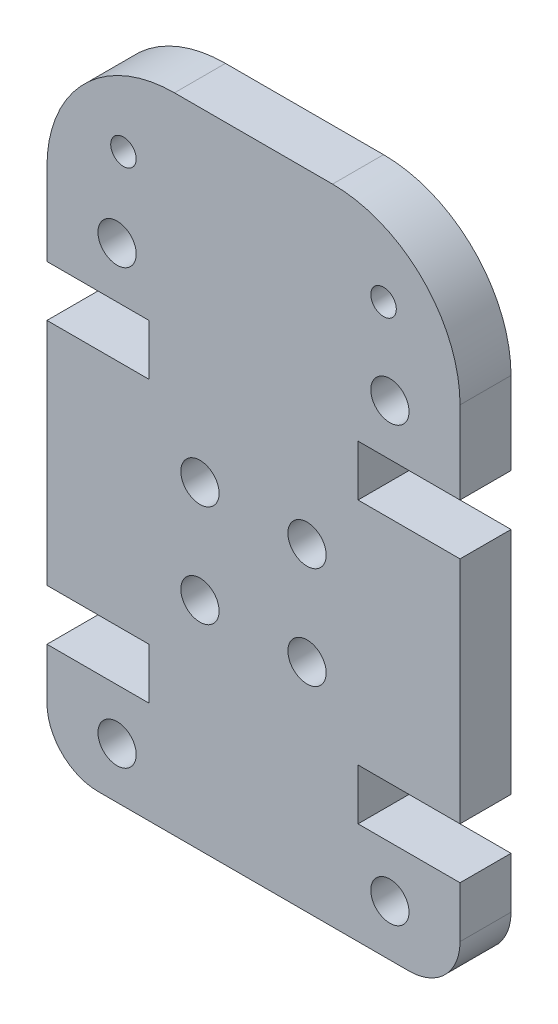
ISO-10303-21;
HEADER;
FILE_DESCRIPTION(('STEP AP214'),'2;1');
FILE_NAME('part.step','',(''),(''),'','','');
FILE_SCHEMA(('AUTOMOTIVE_DESIGN { 1 0 10303 214 1 1 1 1 }'));
ENDSEC;
DATA;
#1=APPLICATION_CONTEXT('core data for automotive mechanical design processes');
#2=APPLICATION_PROTOCOL_DEFINITION('international standard','automotive_design',2000,#1);
#3=PRODUCT_CONTEXT('',#1,'mechanical');
#4=PRODUCT('Part','Part','',(#3));
#5=PRODUCT_RELATED_PRODUCT_CATEGORY('part','',(#4));
#6=PRODUCT_DEFINITION_FORMATION('','',#4);
#7=PRODUCT_DEFINITION_CONTEXT('part definition',#1,'design');
#8=PRODUCT_DEFINITION('design','',#6,#7);
#9=PRODUCT_DEFINITION_SHAPE('','',#8);
#10=(LENGTH_UNIT() NAMED_UNIT(*) SI_UNIT(.MILLI.,.METRE.));
#11=(NAMED_UNIT(*) PLANE_ANGLE_UNIT() SI_UNIT($,.RADIAN.));
#12=(NAMED_UNIT(*) SI_UNIT($,.STERADIAN.) SOLID_ANGLE_UNIT());
#13=UNCERTAINTY_MEASURE_WITH_UNIT(LENGTH_MEASURE(1.E-05),#10,'distance_accuracy_value','');
#14=(GEOMETRIC_REPRESENTATION_CONTEXT(3) GLOBAL_UNCERTAINTY_ASSIGNED_CONTEXT((#13)) GLOBAL_UNIT_ASSIGNED_CONTEXT((#10,
#11,#12)) REPRESENTATION_CONTEXT('',''));
#15=CARTESIAN_POINT('',(0.,0.,0.));
#16=DIRECTION('',(0.,0.,1.));
#17=DIRECTION('',(1.,0.,0.));
#18=AXIS2_PLACEMENT_3D('',#15,#16,#17);
#19=CARTESIAN_POINT('',(14.2,2.00000000000003,2.));
#20=DIRECTION('',(0.,0.,-1.));
#21=DIRECTION('',(-1.,0.,0.));
#22=AXIS2_PLACEMENT_3D('',#19,#20,#21);
#23=PLANE('',#22);
#24=CARTESIAN_POINT('',(3.00000000000323,22.2299999999968,2.));
#25=DIRECTION('',(0.,0.,1.));
#26=DIRECTION('',(1.,0.,0.));
#27=AXIS2_PLACEMENT_3D('',#24,#25,#26);
#28=CIRCLE('',#27,0.499999999999944);
#29=CARTESIAN_POINT('',(3.50000000000317,22.2299999999968,2.));
#30=VERTEX_POINT('',#29);
#31=EDGE_CURVE('E472',#30,#30,#28,.T.);
#32=ORIENTED_EDGE('',*,*,#31,.F.);
#33=EDGE_LOOP('',(#32));
#34=FACE_BOUND('',#33,.T.);
#35=CARTESIAN_POINT('',(2.75000000000002,19.0000000000043,2.));
#36=DIRECTION('',(0.,0.,1.));
#37=DIRECTION('',(-1.,0.,0.));
#38=AXIS2_PLACEMENT_3D('',#35,#36,#37);
#39=CIRCLE('',#38,0.749999999999999);
#40=CARTESIAN_POINT('',(2.00000000000002,19.0000000000043,2.));
#41=VERTEX_POINT('',#40);
#42=EDGE_CURVE('E484',#41,#41,#39,.T.);
#43=ORIENTED_EDGE('',*,*,#42,.F.);
#44=EDGE_LOOP('',(#43));
#45=FACE_BOUND('',#44,.T.);
#46=CARTESIAN_POINT('',(10.1999999999989,12.5000000000022,2.));
#47=DIRECTION('',(0.,0.,1.));
#48=DIRECTION('',(1.,0.,0.));
#49=AXIS2_PLACEMENT_3D('',#46,#47,#48);
#50=CIRCLE('',#49,0.749999999999998);
#51=CARTESIAN_POINT('',(10.9499999999989,12.5000000000022,2.));
#52=VERTEX_POINT('',#51);
#53=EDGE_CURVE('E496',#52,#52,#50,.T.);
#54=ORIENTED_EDGE('',*,*,#53,.F.);
#55=EDGE_LOOP('',(#54));
#56=FACE_BOUND('',#55,.T.);
#57=CARTESIAN_POINT('',(10.1999999999989,8.5000000000022,2.));
#58=DIRECTION('',(0.,0.,1.));
#59=DIRECTION('',(-1.,0.,0.));
#60=AXIS2_PLACEMENT_3D('',#57,#58,#59);
#61=CIRCLE('',#60,0.749999999999998);
#62=CARTESIAN_POINT('',(9.44999999999887,8.5000000000022,2.));
#63=VERTEX_POINT('',#62);
#64=EDGE_CURVE('E508',#63,#63,#61,.T.);
#65=ORIENTED_EDGE('',*,*,#64,.F.);
#66=EDGE_LOOP('',(#65));
#67=FACE_BOUND('',#66,.T.);
#68=CARTESIAN_POINT('',(13.45,2.00000000000003,2.));
#69=DIRECTION('',(0.,0.,1.));
#70=DIRECTION('',(-1.,0.,0.));
#71=AXIS2_PLACEMENT_3D('',#68,#69,#70);
#72=CIRCLE('',#71,0.750000000000002);
#73=CARTESIAN_POINT('',(12.7,2.00000000000003,2.));
#74=VERTEX_POINT('',#73);
#75=EDGE_CURVE('E230',#74,#74,#72,.T.);
#76=ORIENTED_EDGE('',*,*,#75,.F.);
#77=EDGE_LOOP('',(#76));
#78=FACE_BOUND('',#77,.T.);
#79=CARTESIAN_POINT('',(14.2,2.00000000000003,2.));
#80=DIRECTION('',(0.,0.,1.));
#81=DIRECTION('',(-1.,0.,0.));
#82=AXIS2_PLACEMENT_3D('',#79,#80,#81);
#83=CIRCLE('',#82,2.00000000000003);
#84=CARTESIAN_POINT('',(14.2,0.,2.));
#85=VERTEX_POINT('',#84);
#86=CARTESIAN_POINT('',(16.2,2.00000000000003,2.));
#87=VERTEX_POINT('',#86);
#88=EDGE_CURVE('E273',#85,#87,#83,.T.);
#89=ORIENTED_EDGE('',*,*,#88,.T.);
#90=DIRECTION('',(0.,1.,0.));
#91=VECTOR('',#90,1.);
#92=CARTESIAN_POINT('',(16.2,2.00000000000003,2.));
#93=LINE('',#92,#91);
#94=CARTESIAN_POINT('',(16.2,4.00000000000006,2.));
#95=VERTEX_POINT('',#94);
#96=EDGE_CURVE('E141',#87,#95,#93,.T.);
#97=ORIENTED_EDGE('',*,*,#96,.T.);
#98=DIRECTION('',(-1.,0.,0.));
#99=VECTOR('',#98,1.);
#100=CARTESIAN_POINT('',(12.1999999999999,4.00000000000006,2.));
#101=LINE('',#100,#99);
#102=CARTESIAN_POINT('',(12.1999999999999,4.00000000000006,2.));
#103=VERTEX_POINT('',#102);
#104=EDGE_CURVE('E336',#95,#103,#101,.T.);
#105=ORIENTED_EDGE('',*,*,#104,.T.);
#106=DIRECTION('',(0.,1.,0.));
#107=VECTOR('',#106,1.);
#108=CARTESIAN_POINT('',(12.1999999999999,6.00000000000009,2.));
#109=LINE('',#108,#107);
#110=CARTESIAN_POINT('',(12.1999999999999,6.00000000000009,2.));
#111=VERTEX_POINT('',#110);
#112=EDGE_CURVE('E355',#103,#111,#109,.T.);
#113=ORIENTED_EDGE('',*,*,#112,.T.);
#114=DIRECTION('',(1.,0.,0.));
#115=VECTOR('',#114,1.);
#116=CARTESIAN_POINT('',(16.2,6.00000000000009,2.));
#117=LINE('',#116,#115);
#118=CARTESIAN_POINT('',(16.2,6.00000000000009,2.));
#119=VERTEX_POINT('',#118);
#120=EDGE_CURVE('E352',#111,#119,#117,.T.);
#121=ORIENTED_EDGE('',*,*,#120,.T.);
#122=DIRECTION('',(0.,1.,0.));
#123=VECTOR('',#122,1.);
#124=CARTESIAN_POINT('',(16.2,6.00000000000009,2.));
#125=LINE('',#124,#123);
#126=CARTESIAN_POINT('',(16.2,15.0000000000043,2.));
#127=VERTEX_POINT('',#126);
#128=EDGE_CURVE('E354',#119,#127,#125,.T.);
#129=ORIENTED_EDGE('',*,*,#128,.T.);
#130=DIRECTION('',(-1.,0.,0.));
#131=VECTOR('',#130,1.);
#132=CARTESIAN_POINT('',(16.2,15.0000000000043,2.));
#133=LINE('',#132,#131);
#134=CARTESIAN_POINT('',(12.1999999999999,15.0000000000043,2.));
#135=VERTEX_POINT('',#134);
#136=EDGE_CURVE('E357',#127,#135,#133,.T.);
#137=ORIENTED_EDGE('',*,*,#136,.T.);
#138=DIRECTION('',(0.,1.,0.));
#139=VECTOR('',#138,1.);
#140=CARTESIAN_POINT('',(12.1999999999999,15.0000000000043,2.));
#141=LINE('',#140,#139);
#142=CARTESIAN_POINT('',(12.1999999999999,17.0000000000043,2.));
#143=VERTEX_POINT('',#142);
#144=EDGE_CURVE('E363',#135,#143,#141,.T.);
#145=ORIENTED_EDGE('',*,*,#144,.T.);
#146=DIRECTION('',(1.,0.,0.));
#147=VECTOR('',#146,1.);
#148=CARTESIAN_POINT('',(12.1999999999999,17.0000000000043,2.));
#149=LINE('',#148,#147);
#150=CARTESIAN_POINT('',(16.2,17.0000000000043,2.));
#151=VERTEX_POINT('',#150);
#152=EDGE_CURVE('E365',#143,#151,#149,.T.);
#153=ORIENTED_EDGE('',*,*,#152,.T.);
#154=DIRECTION('',(0.,1.,0.));
#155=VECTOR('',#154,1.);
#156=CARTESIAN_POINT('',(16.2,20.23,2.));
#157=LINE('',#156,#155);
#158=CARTESIAN_POINT('',(16.2,20.23,2.));
#159=VERTEX_POINT('',#158);
#160=EDGE_CURVE('E367',#151,#159,#157,.T.);
#161=ORIENTED_EDGE('',*,*,#160,.T.);
#162=CARTESIAN_POINT('',(11.2,20.23,2.));
#163=DIRECTION('',(0.,0.,1.));
#164=DIRECTION('',(-1.,0.,0.));
#165=AXIS2_PLACEMENT_3D('',#162,#163,#164);
#166=CIRCLE('',#165,5.00000000000002);
#167=CARTESIAN_POINT('',(11.2,25.23,2.));
#168=VERTEX_POINT('',#167);
#169=EDGE_CURVE('E369',#159,#168,#166,.T.);
#170=ORIENTED_EDGE('',*,*,#169,.T.);
#171=DIRECTION('',(-1.,0.,0.));
#172=VECTOR('',#171,1.);
#173=CARTESIAN_POINT('',(5.00000000000002,25.23,2.));
#174=LINE('',#173,#172);
#175=CARTESIAN_POINT('',(5.00000000000002,25.23,2.));
#176=VERTEX_POINT('',#175);
#177=EDGE_CURVE('E371',#168,#176,#174,.T.);
#178=ORIENTED_EDGE('',*,*,#177,.T.);
#179=CARTESIAN_POINT('',(5.00000000000002,20.23,2.));
#180=DIRECTION('',(0.,0.,1.));
#181=DIRECTION('',(1.,0.,0.));
#182=AXIS2_PLACEMENT_3D('',#179,#180,#181);
#183=CIRCLE('',#182,5.00000000000002);
#184=CARTESIAN_POINT('',(0.,20.23,2.));
#185=VERTEX_POINT('',#184);
#186=EDGE_CURVE('E373',#176,#185,#183,.T.);
#187=ORIENTED_EDGE('',*,*,#186,.T.);
#188=DIRECTION('',(0.,-1.,0.));
#189=VECTOR('',#188,1.);
#190=CARTESIAN_POINT('',(0.,20.23,2.));
#191=LINE('',#190,#189);
#192=CARTESIAN_POINT('',(0.,17.0000000000043,2.));
#193=VERTEX_POINT('',#192);
#194=EDGE_CURVE('E375',#185,#193,#191,.T.);
#195=ORIENTED_EDGE('',*,*,#194,.T.);
#196=DIRECTION('',(1.,0.,0.));
#197=VECTOR('',#196,1.);
#198=CARTESIAN_POINT('',(4.00000000000004,17.0000000000043,2.));
#199=LINE('',#198,#197);
#200=CARTESIAN_POINT('',(4.00000000000004,17.0000000000043,2.));
#201=VERTEX_POINT('',#200);
#202=EDGE_CURVE('E377',#193,#201,#199,.T.);
#203=ORIENTED_EDGE('',*,*,#202,.T.);
#204=DIRECTION('',(0.,-1.,0.));
#205=VECTOR('',#204,1.);
#206=CARTESIAN_POINT('',(4.00000000000004,15.0000000000043,2.));
#207=LINE('',#206,#205);
#208=CARTESIAN_POINT('',(4.00000000000004,15.0000000000043,2.));
#209=VERTEX_POINT('',#208);
#210=EDGE_CURVE('E379',#201,#209,#207,.T.);
#211=ORIENTED_EDGE('',*,*,#210,.T.);
#212=DIRECTION('',(-1.,0.,0.));
#213=VECTOR('',#212,1.);
#214=CARTESIAN_POINT('',(0.,15.0000000000043,2.));
#215=LINE('',#214,#213);
#216=CARTESIAN_POINT('',(0.,15.0000000000043,2.));
#217=VERTEX_POINT('',#216);
#218=EDGE_CURVE('E381',#209,#217,#215,.T.);
#219=ORIENTED_EDGE('',*,*,#218,.T.);
#220=DIRECTION('',(0.,-1.,0.));
#221=VECTOR('',#220,1.);
#222=CARTESIAN_POINT('',(0.,6.00000000000003,2.));
#223=LINE('',#222,#221);
#224=CARTESIAN_POINT('',(0.,6.00000000000003,2.));
#225=VERTEX_POINT('',#224);
#226=EDGE_CURVE('E383',#217,#225,#223,.T.);
#227=ORIENTED_EDGE('',*,*,#226,.T.);
#228=DIRECTION('',(1.,0.,0.));
#229=VECTOR('',#228,1.);
#230=CARTESIAN_POINT('',(0.,6.00000000000003,2.));
#231=LINE('',#230,#229);
#232=CARTESIAN_POINT('',(4.00000000000004,6.00000000000003,2.));
#233=VERTEX_POINT('',#232);
#234=EDGE_CURVE('E385',#225,#233,#231,.T.);
#235=ORIENTED_EDGE('',*,*,#234,.T.);
#236=DIRECTION('',(0.,-1.,0.));
#237=VECTOR('',#236,1.);
#238=CARTESIAN_POINT('',(4.00000000000004,6.00000000000003,2.));
#239=LINE('',#238,#237);
#240=CARTESIAN_POINT('',(4.00000000000004,4.00000000000002,2.));
#241=VERTEX_POINT('',#240);
#242=EDGE_CURVE('E387',#233,#241,#239,.T.);
#243=ORIENTED_EDGE('',*,*,#242,.T.);
#244=DIRECTION('',(-1.,0.,0.));
#245=VECTOR('',#244,1.);
#246=CARTESIAN_POINT('',(4.00000000000004,4.00000000000002,2.));
#247=LINE('',#246,#245);
#248=CARTESIAN_POINT('',(0.,4.,2.));
#249=VERTEX_POINT('',#248);
#250=EDGE_CURVE('E208',#241,#249,#247,.T.);
#251=ORIENTED_EDGE('',*,*,#250,.T.);
#252=DIRECTION('',(0.,-1.,0.));
#253=VECTOR('',#252,1.);
#254=CARTESIAN_POINT('',(0.,2.00000000000003,2.));
#255=LINE('',#254,#253);
#256=CARTESIAN_POINT('',(0.,2.00000000000003,2.));
#257=VERTEX_POINT('',#256);
#258=EDGE_CURVE('E202',#249,#257,#255,.T.);
#259=ORIENTED_EDGE('',*,*,#258,.T.);
#260=CARTESIAN_POINT('',(2.00000000000001,2.00000000000003,2.));
#261=DIRECTION('',(0.,0.,1.));
#262=DIRECTION('',(1.,0.,0.));
#263=AXIS2_PLACEMENT_3D('',#260,#261,#262);
#264=CIRCLE('',#263,2.00000000000001);
#265=CARTESIAN_POINT('',(2.00000000000001,0.,2.));
#266=VERTEX_POINT('',#265);
#267=EDGE_CURVE('E206',#257,#266,#264,.T.);
#268=ORIENTED_EDGE('',*,*,#267,.T.);
#269=DIRECTION('',(1.,0.,0.));
#270=VECTOR('',#269,1.);
#271=CARTESIAN_POINT('',(2.00000000000001,0.,2.));
#272=LINE('',#271,#270);
#273=EDGE_CURVE('E50',#266,#85,#272,.T.);
#274=ORIENTED_EDGE('',*,*,#273,.T.);
#275=EDGE_LOOP('',(#89,#97,#105,#113,#121,#129,#137,#145,#153,#161,#170,#178,#187,#195,#203,
#211,#219,#227,#235,#243,#251,#259,#268,#274));
#276=FACE_BOUND('',#275,.T.);
#277=CARTESIAN_POINT('',(13.1999999999968,22.2299999999968,2.));
#278=DIRECTION('',(0.,0.,1.));
#279=DIRECTION('',(-1.,0.,0.));
#280=AXIS2_PLACEMENT_3D('',#277,#278,#279);
#281=CIRCLE('',#280,0.499999999999944);
#282=CARTESIAN_POINT('',(12.6999999999968,22.2299999999968,2.));
#283=VERTEX_POINT('',#282);
#284=EDGE_CURVE('E514',#283,#283,#281,.T.);
#285=ORIENTED_EDGE('',*,*,#284,.F.);
#286=EDGE_LOOP('',(#285));
#287=FACE_BOUND('',#286,.T.);
#288=CARTESIAN_POINT('',(13.45,19.0000000000043,2.));
#289=DIRECTION('',(0.,0.,1.));
#290=DIRECTION('',(1.,0.,0.));
#291=AXIS2_PLACEMENT_3D('',#288,#289,#290);
#292=CIRCLE('',#291,0.749999999999999);
#293=CARTESIAN_POINT('',(14.2,19.0000000000043,2.));
#294=VERTEX_POINT('',#293);
#295=EDGE_CURVE('E502',#294,#294,#292,.T.);
#296=ORIENTED_EDGE('',*,*,#295,.F.);
#297=EDGE_LOOP('',(#296));
#298=FACE_BOUND('',#297,.T.);
#299=CARTESIAN_POINT('',(6.00000000000113,8.5000000000022,2.));
#300=DIRECTION('',(0.,0.,1.));
#301=DIRECTION('',(1.,0.,0.));
#302=AXIS2_PLACEMENT_3D('',#299,#300,#301);
#303=CIRCLE('',#302,0.749999999999999);
#304=CARTESIAN_POINT('',(6.75000000000113,8.5000000000022,2.));
#305=VERTEX_POINT('',#304);
#306=EDGE_CURVE('E490',#305,#305,#303,.T.);
#307=ORIENTED_EDGE('',*,*,#306,.F.);
#308=EDGE_LOOP('',(#307));
#309=FACE_BOUND('',#308,.T.);
#310=CARTESIAN_POINT('',(6.00000000000113,12.5000000000022,2.));
#311=DIRECTION('',(0.,0.,1.));
#312=DIRECTION('',(-1.,0.,0.));
#313=AXIS2_PLACEMENT_3D('',#310,#311,#312);
#314=CIRCLE('',#313,0.749999999999999);
#315=CARTESIAN_POINT('',(5.25000000000113,12.5000000000022,2.));
#316=VERTEX_POINT('',#315);
#317=EDGE_CURVE('E478',#316,#316,#314,.T.);
#318=ORIENTED_EDGE('',*,*,#317,.F.);
#319=EDGE_LOOP('',(#318));
#320=FACE_BOUND('',#319,.T.);
#321=CARTESIAN_POINT('',(2.75000000000002,2.00000000000025,2.));
#322=DIRECTION('',(0.,0.,1.));
#323=DIRECTION('',(1.,0.,0.));
#324=AXIS2_PLACEMENT_3D('',#321,#322,#323);
#325=CIRCLE('',#324,0.750000000002987);
#326=CARTESIAN_POINT('',(3.50000000000301,2.00000000000025,2.));
#327=VERTEX_POINT('',#326);
#328=EDGE_CURVE('E463',#327,#327,#325,.T.);
#329=ORIENTED_EDGE('',*,*,#328,.F.);
#330=EDGE_LOOP('',(#329));
#331=FACE_BOUND('',#330,.T.);
#332=ADVANCED_FACE('F33',(#34,#45,#56,#67,#78,#276,#287,#298,#309,#320,#331),#23,.F.);
#333=CARTESIAN_POINT('',(14.2,2.00000000000003,0.));
#334=DIRECTION('',(0.,0.,-1.));
#335=DIRECTION('',(-1.,0.,0.));
#336=AXIS2_PLACEMENT_3D('',#333,#334,#335);
#337=PLANE('',#336);
#338=CARTESIAN_POINT('',(3.00000000000323,22.2299999999968,0.));
#339=DIRECTION('',(0.,0.,1.));
#340=DIRECTION('',(1.,0.,0.));
#341=AXIS2_PLACEMENT_3D('',#338,#339,#340);
#342=CIRCLE('',#341,0.499999999999944);
#343=CARTESIAN_POINT('',(3.50000000000317,22.2299999999968,0.));
#344=VERTEX_POINT('',#343);
#345=EDGE_CURVE('E469',#344,#344,#342,.T.);
#346=ORIENTED_EDGE('',*,*,#345,.T.);
#347=EDGE_LOOP('',(#346));
#348=FACE_BOUND('',#347,.T.);
#349=CARTESIAN_POINT('',(2.75000000000002,19.0000000000043,0.));
#350=DIRECTION('',(0.,0.,1.));
#351=DIRECTION('',(-1.,0.,0.));
#352=AXIS2_PLACEMENT_3D('',#349,#350,#351);
#353=CIRCLE('',#352,0.749999999999999);
#354=CARTESIAN_POINT('',(2.00000000000002,19.0000000000043,0.));
#355=VERTEX_POINT('',#354);
#356=EDGE_CURVE('E481',#355,#355,#353,.T.);
#357=ORIENTED_EDGE('',*,*,#356,.T.);
#358=EDGE_LOOP('',(#357));
#359=FACE_BOUND('',#358,.T.);
#360=CARTESIAN_POINT('',(10.1999999999989,12.5000000000022,0.));
#361=DIRECTION('',(0.,0.,1.));
#362=DIRECTION('',(1.,0.,0.));
#363=AXIS2_PLACEMENT_3D('',#360,#361,#362);
#364=CIRCLE('',#363,0.749999999999998);
#365=CARTESIAN_POINT('',(10.9499999999989,12.5000000000022,0.));
#366=VERTEX_POINT('',#365);
#367=EDGE_CURVE('E493',#366,#366,#364,.T.);
#368=ORIENTED_EDGE('',*,*,#367,.T.);
#369=EDGE_LOOP('',(#368));
#370=FACE_BOUND('',#369,.T.);
#371=CARTESIAN_POINT('',(10.1999999999989,8.5000000000022,0.));
#372=DIRECTION('',(0.,0.,1.));
#373=DIRECTION('',(-1.,0.,0.));
#374=AXIS2_PLACEMENT_3D('',#371,#372,#373);
#375=CIRCLE('',#374,0.749999999999998);
#376=CARTESIAN_POINT('',(9.44999999999887,8.5000000000022,0.));
#377=VERTEX_POINT('',#376);
#378=EDGE_CURVE('E505',#377,#377,#375,.T.);
#379=ORIENTED_EDGE('',*,*,#378,.T.);
#380=EDGE_LOOP('',(#379));
#381=FACE_BOUND('',#380,.T.);
#382=CARTESIAN_POINT('',(13.45,2.00000000000003,0.));
#383=DIRECTION('',(0.,0.,1.));
#384=DIRECTION('',(-1.,0.,0.));
#385=AXIS2_PLACEMENT_3D('',#382,#383,#384);
#386=CIRCLE('',#385,0.750000000000002);
#387=CARTESIAN_POINT('',(12.7,2.00000000000003,0.));
#388=VERTEX_POINT('',#387);
#389=EDGE_CURVE('E517',#388,#388,#386,.T.);
#390=ORIENTED_EDGE('',*,*,#389,.T.);
#391=EDGE_LOOP('',(#390));
#392=FACE_BOUND('',#391,.T.);
#393=CARTESIAN_POINT('',(14.2,2.00000000000003,0.));
#394=DIRECTION('',(0.,0.,1.));
#395=DIRECTION('',(-1.,0.,0.));
#396=AXIS2_PLACEMENT_3D('',#393,#394,#395);
#397=CIRCLE('',#396,2.00000000000003);
#398=CARTESIAN_POINT('',(14.2,0.,0.));
#399=VERTEX_POINT('',#398);
#400=CARTESIAN_POINT('',(16.2,2.00000000000003,0.));
#401=VERTEX_POINT('',#400);
#402=EDGE_CURVE('E226',#399,#401,#397,.T.);
#403=ORIENTED_EDGE('',*,*,#402,.F.);
#404=DIRECTION('',(1.,0.,0.));
#405=VECTOR('',#404,1.);
#406=CARTESIAN_POINT('',(2.00000000000001,0.,0.));
#407=LINE('',#406,#405);
#408=CARTESIAN_POINT('',(2.00000000000001,0.,0.));
#409=VERTEX_POINT('',#408);
#410=EDGE_CURVE('E133',#409,#399,#407,.T.);
#411=ORIENTED_EDGE('',*,*,#410,.F.);
#412=CARTESIAN_POINT('',(2.00000000000001,2.00000000000003,0.));
#413=DIRECTION('',(0.,0.,1.));
#414=DIRECTION('',(1.,0.,0.));
#415=AXIS2_PLACEMENT_3D('',#412,#413,#414);
#416=CIRCLE('',#415,2.00000000000001);
#417=CARTESIAN_POINT('',(0.,2.00000000000003,0.));
#418=VERTEX_POINT('',#417);
#419=EDGE_CURVE('E127',#418,#409,#416,.T.);
#420=ORIENTED_EDGE('',*,*,#419,.F.);
#421=DIRECTION('',(0.,-1.,0.));
#422=VECTOR('',#421,1.);
#423=CARTESIAN_POINT('',(0.,2.00000000000003,0.));
#424=LINE('',#423,#422);
#425=CARTESIAN_POINT('',(0.,4.,0.));
#426=VERTEX_POINT('',#425);
#427=EDGE_CURVE('E216',#426,#418,#424,.T.);
#428=ORIENTED_EDGE('',*,*,#427,.F.);
#429=DIRECTION('',(-1.,0.,0.));
#430=VECTOR('',#429,1.);
#431=CARTESIAN_POINT('',(4.00000000000004,4.00000000000002,0.));
#432=LINE('',#431,#430);
#433=CARTESIAN_POINT('',(4.00000000000004,4.00000000000002,0.));
#434=VERTEX_POINT('',#433);
#435=EDGE_CURVE('E268',#434,#426,#432,.T.);
#436=ORIENTED_EDGE('',*,*,#435,.F.);
#437=DIRECTION('',(0.,-1.,0.));
#438=VECTOR('',#437,1.);
#439=CARTESIAN_POINT('',(4.00000000000004,6.00000000000003,0.));
#440=LINE('',#439,#438);
#441=CARTESIAN_POINT('',(4.00000000000004,6.00000000000003,0.));
#442=VERTEX_POINT('',#441);
#443=EDGE_CURVE('E266',#442,#434,#440,.T.);
#444=ORIENTED_EDGE('',*,*,#443,.F.);
#445=DIRECTION('',(1.,0.,0.));
#446=VECTOR('',#445,1.);
#447=CARTESIAN_POINT('',(0.,6.00000000000003,0.));
#448=LINE('',#447,#446);
#449=CARTESIAN_POINT('',(0.,6.00000000000003,0.));
#450=VERTEX_POINT('',#449);
#451=EDGE_CURVE('E264',#450,#442,#448,.T.);
#452=ORIENTED_EDGE('',*,*,#451,.F.);
#453=DIRECTION('',(0.,-1.,0.));
#454=VECTOR('',#453,1.);
#455=CARTESIAN_POINT('',(0.,6.00000000000003,0.));
#456=LINE('',#455,#454);
#457=CARTESIAN_POINT('',(0.,15.0000000000043,0.));
#458=VERTEX_POINT('',#457);
#459=EDGE_CURVE('E262',#458,#450,#456,.T.);
#460=ORIENTED_EDGE('',*,*,#459,.F.);
#461=DIRECTION('',(-1.,0.,0.));
#462=VECTOR('',#461,1.);
#463=CARTESIAN_POINT('',(0.,15.0000000000043,0.));
#464=LINE('',#463,#462);
#465=CARTESIAN_POINT('',(4.00000000000004,15.0000000000043,0.));
#466=VERTEX_POINT('',#465);
#467=EDGE_CURVE('E260',#466,#458,#464,.T.);
#468=ORIENTED_EDGE('',*,*,#467,.F.);
#469=DIRECTION('',(0.,-1.,0.));
#470=VECTOR('',#469,1.);
#471=CARTESIAN_POINT('',(4.00000000000004,15.0000000000043,0.));
#472=LINE('',#471,#470);
#473=CARTESIAN_POINT('',(4.00000000000004,17.0000000000043,0.));
#474=VERTEX_POINT('',#473);
#475=EDGE_CURVE('E258',#474,#466,#472,.T.);
#476=ORIENTED_EDGE('',*,*,#475,.F.);
#477=DIRECTION('',(1.,0.,0.));
#478=VECTOR('',#477,1.);
#479=CARTESIAN_POINT('',(4.00000000000004,17.0000000000043,0.));
#480=LINE('',#479,#478);
#481=CARTESIAN_POINT('',(0.,17.0000000000043,0.));
#482=VERTEX_POINT('',#481);
#483=EDGE_CURVE('E256',#482,#474,#480,.T.);
#484=ORIENTED_EDGE('',*,*,#483,.F.);
#485=DIRECTION('',(0.,-1.,0.));
#486=VECTOR('',#485,1.);
#487=CARTESIAN_POINT('',(0.,20.23,0.));
#488=LINE('',#487,#486);
#489=CARTESIAN_POINT('',(0.,20.23,0.));
#490=VERTEX_POINT('',#489);
#491=EDGE_CURVE('E254',#490,#482,#488,.T.);
#492=ORIENTED_EDGE('',*,*,#491,.F.);
#493=CARTESIAN_POINT('',(5.00000000000002,20.23,0.));
#494=DIRECTION('',(0.,0.,1.));
#495=DIRECTION('',(1.,0.,0.));
#496=AXIS2_PLACEMENT_3D('',#493,#494,#495);
#497=CIRCLE('',#496,5.00000000000002);
#498=CARTESIAN_POINT('',(5.00000000000002,25.23,0.));
#499=VERTEX_POINT('',#498);
#500=EDGE_CURVE('E252',#499,#490,#497,.T.);
#501=ORIENTED_EDGE('',*,*,#500,.F.);
#502=DIRECTION('',(-1.,0.,0.));
#503=VECTOR('',#502,1.);
#504=CARTESIAN_POINT('',(5.00000000000002,25.23,0.));
#505=LINE('',#504,#503);
#506=CARTESIAN_POINT('',(11.2,25.23,0.));
#507=VERTEX_POINT('',#506);
#508=EDGE_CURVE('E250',#507,#499,#505,.T.);
#509=ORIENTED_EDGE('',*,*,#508,.F.);
#510=CARTESIAN_POINT('',(11.2,20.23,0.));
#511=DIRECTION('',(0.,0.,1.));
#512=DIRECTION('',(-1.,0.,0.));
#513=AXIS2_PLACEMENT_3D('',#510,#511,#512);
#514=CIRCLE('',#513,5.00000000000002);
#515=CARTESIAN_POINT('',(16.2,20.23,0.));
#516=VERTEX_POINT('',#515);
#517=EDGE_CURVE('E248',#516,#507,#514,.T.);
#518=ORIENTED_EDGE('',*,*,#517,.F.);
#519=DIRECTION('',(0.,1.,0.));
#520=VECTOR('',#519,1.);
#521=CARTESIAN_POINT('',(16.2,20.23,0.));
#522=LINE('',#521,#520);
#523=CARTESIAN_POINT('',(16.2,17.0000000000043,0.));
#524=VERTEX_POINT('',#523);
#525=EDGE_CURVE('E246',#524,#516,#522,.T.);
#526=ORIENTED_EDGE('',*,*,#525,.F.);
#527=DIRECTION('',(1.,0.,0.));
#528=VECTOR('',#527,1.);
#529=CARTESIAN_POINT('',(12.1999999999999,17.0000000000043,0.));
#530=LINE('',#529,#528);
#531=CARTESIAN_POINT('',(12.1999999999999,17.0000000000043,0.));
#532=VERTEX_POINT('',#531);
#533=EDGE_CURVE('E244',#532,#524,#530,.T.);
#534=ORIENTED_EDGE('',*,*,#533,.F.);
#535=DIRECTION('',(0.,1.,0.));
#536=VECTOR('',#535,1.);
#537=CARTESIAN_POINT('',(12.1999999999999,15.0000000000043,0.));
#538=LINE('',#537,#536);
#539=CARTESIAN_POINT('',(12.1999999999999,15.0000000000043,0.));
#540=VERTEX_POINT('',#539);
#541=EDGE_CURVE('E242',#540,#532,#538,.T.);
#542=ORIENTED_EDGE('',*,*,#541,.F.);
#543=DIRECTION('',(-1.,0.,0.));
#544=VECTOR('',#543,1.);
#545=CARTESIAN_POINT('',(16.2,15.0000000000043,0.));
#546=LINE('',#545,#544);
#547=CARTESIAN_POINT('',(16.2,15.0000000000043,0.));
#548=VERTEX_POINT('',#547);
#549=EDGE_CURVE('E240',#548,#540,#546,.T.);
#550=ORIENTED_EDGE('',*,*,#549,.F.);
#551=DIRECTION('',(0.,1.,0.));
#552=VECTOR('',#551,1.);
#553=CARTESIAN_POINT('',(16.2,6.00000000000009,0.));
#554=LINE('',#553,#552);
#555=CARTESIAN_POINT('',(16.2,6.00000000000009,0.));
#556=VERTEX_POINT('',#555);
#557=EDGE_CURVE('E238',#556,#548,#554,.T.);
#558=ORIENTED_EDGE('',*,*,#557,.F.);
#559=DIRECTION('',(1.,0.,0.));
#560=VECTOR('',#559,1.);
#561=CARTESIAN_POINT('',(16.2,6.00000000000009,0.));
#562=LINE('',#561,#560);
#563=CARTESIAN_POINT('',(12.1999999999999,6.00000000000009,0.));
#564=VERTEX_POINT('',#563);
#565=EDGE_CURVE('E236',#564,#556,#562,.T.);
#566=ORIENTED_EDGE('',*,*,#565,.F.);
#567=DIRECTION('',(0.,1.,0.));
#568=VECTOR('',#567,1.);
#569=CARTESIAN_POINT('',(12.1999999999999,6.00000000000009,0.));
#570=LINE('',#569,#568);
#571=CARTESIAN_POINT('',(12.1999999999999,4.00000000000006,0.));
#572=VERTEX_POINT('',#571);
#573=EDGE_CURVE('E234',#572,#564,#570,.T.);
#574=ORIENTED_EDGE('',*,*,#573,.F.);
#575=DIRECTION('',(-1.,0.,0.));
#576=VECTOR('',#575,1.);
#577=CARTESIAN_POINT('',(12.1999999999999,4.00000000000006,0.));
#578=LINE('',#577,#576);
#579=CARTESIAN_POINT('',(16.2,4.00000000000006,0.));
#580=VERTEX_POINT('',#579);
#581=EDGE_CURVE('E232',#580,#572,#578,.T.);
#582=ORIENTED_EDGE('',*,*,#581,.F.);
#583=DIRECTION('',(0.,1.,0.));
#584=VECTOR('',#583,1.);
#585=CARTESIAN_POINT('',(16.2,2.00000000000003,0.));
#586=LINE('',#585,#584);
#587=EDGE_CURVE('E229',#401,#580,#586,.T.);
#588=ORIENTED_EDGE('',*,*,#587,.F.);
#589=EDGE_LOOP('',(#403,#411,#420,#428,#436,#444,#452,#460,#468,#476,#484,#492,#501,#509,#518,
#526,#534,#542,#550,#558,#566,#574,#582,#588));
#590=FACE_BOUND('',#589,.T.);
#591=CARTESIAN_POINT('',(13.1999999999968,22.2299999999968,0.));
#592=DIRECTION('',(0.,0.,1.));
#593=DIRECTION('',(-1.,0.,0.));
#594=AXIS2_PLACEMENT_3D('',#591,#592,#593);
#595=CIRCLE('',#594,0.499999999999944);
#596=CARTESIAN_POINT('',(12.6999999999968,22.2299999999968,0.));
#597=VERTEX_POINT('',#596);
#598=EDGE_CURVE('E511',#597,#597,#595,.T.);
#599=ORIENTED_EDGE('',*,*,#598,.T.);
#600=EDGE_LOOP('',(#599));
#601=FACE_BOUND('',#600,.T.);
#602=CARTESIAN_POINT('',(13.45,19.0000000000043,0.));
#603=DIRECTION('',(0.,0.,1.));
#604=DIRECTION('',(1.,0.,0.));
#605=AXIS2_PLACEMENT_3D('',#602,#603,#604);
#606=CIRCLE('',#605,0.749999999999999);
#607=CARTESIAN_POINT('',(14.2,19.0000000000043,0.));
#608=VERTEX_POINT('',#607);
#609=EDGE_CURVE('E499',#608,#608,#606,.T.);
#610=ORIENTED_EDGE('',*,*,#609,.T.);
#611=EDGE_LOOP('',(#610));
#612=FACE_BOUND('',#611,.T.);
#613=CARTESIAN_POINT('',(6.00000000000113,8.5000000000022,0.));
#614=DIRECTION('',(0.,0.,1.));
#615=DIRECTION('',(1.,0.,0.));
#616=AXIS2_PLACEMENT_3D('',#613,#614,#615);
#617=CIRCLE('',#616,0.749999999999999);
#618=CARTESIAN_POINT('',(6.75000000000113,8.5000000000022,0.));
#619=VERTEX_POINT('',#618);
#620=EDGE_CURVE('E487',#619,#619,#617,.T.);
#621=ORIENTED_EDGE('',*,*,#620,.T.);
#622=EDGE_LOOP('',(#621));
#623=FACE_BOUND('',#622,.T.);
#624=CARTESIAN_POINT('',(6.00000000000113,12.5000000000022,0.));
#625=DIRECTION('',(0.,0.,1.));
#626=DIRECTION('',(-1.,0.,0.));
#627=AXIS2_PLACEMENT_3D('',#624,#625,#626);
#628=CIRCLE('',#627,0.749999999999999);
#629=CARTESIAN_POINT('',(5.25000000000113,12.5000000000022,0.));
#630=VERTEX_POINT('',#629);
#631=EDGE_CURVE('E475',#630,#630,#628,.T.);
#632=ORIENTED_EDGE('',*,*,#631,.T.);
#633=EDGE_LOOP('',(#632));
#634=FACE_BOUND('',#633,.T.);
#635=CARTESIAN_POINT('',(2.75000000000002,2.00000000000025,0.));
#636=DIRECTION('',(0.,0.,1.));
#637=DIRECTION('',(1.,0.,0.));
#638=AXIS2_PLACEMENT_3D('',#635,#636,#637);
#639=CIRCLE('',#638,0.750000000002987);
#640=CARTESIAN_POINT('',(3.50000000000301,2.00000000000025,0.));
#641=VERTEX_POINT('',#640);
#642=EDGE_CURVE('E466',#641,#641,#639,.T.);
#643=ORIENTED_EDGE('',*,*,#642,.T.);
#644=EDGE_LOOP('',(#643));
#645=FACE_BOUND('',#644,.T.);
#646=ADVANCED_FACE('F340',(#348,#359,#370,#381,#392,#590,#601,#612,#623,#634,#645),#337,.T.);
#647=CARTESIAN_POINT('',(14.2,2.00000000000003,2.));
#648=DIRECTION('',(0.,0.,-1.));
#649=DIRECTION('',(-1.,0.,0.));
#650=AXIS2_PLACEMENT_3D('',#647,#648,#649);
#651=CYLINDRICAL_SURFACE('',#650,2.00000000000003);
#652=ORIENTED_EDGE('',*,*,#402,.T.);
#653=DIRECTION('',(0.,0.,-1.));
#654=VECTOR('',#653,1.);
#655=CARTESIAN_POINT('',(16.2,2.00000000000003,2.));
#656=LINE('',#655,#654);
#657=EDGE_CURVE('E11',#87,#401,#656,.T.);
#658=ORIENTED_EDGE('',*,*,#657,.F.);
#659=ORIENTED_EDGE('',*,*,#88,.F.);
#660=DIRECTION('',(0.,0.,-1.));
#661=VECTOR('',#660,1.);
#662=CARTESIAN_POINT('',(14.2,0.,2.));
#663=LINE('',#662,#661);
#664=EDGE_CURVE('E222',#85,#399,#663,.T.);
#665=ORIENTED_EDGE('',*,*,#664,.T.);
#666=EDGE_LOOP('',(#652,#658,#659,#665));
#667=FACE_BOUND('',#666,.T.);
#668=ADVANCED_FACE('F35',(#667),#651,.T.);
#669=CARTESIAN_POINT('',(16.2,2.00000000000003,2.));
#670=DIRECTION('',(-1.,0.,0.));
#671=DIRECTION('',(0.,0.,1.));
#672=AXIS2_PLACEMENT_3D('',#669,#670,#671);
#673=PLANE('',#672);
#674=ORIENTED_EDGE('',*,*,#587,.T.);
#675=DIRECTION('',(0.,0.,-1.));
#676=VECTOR('',#675,1.);
#677=CARTESIAN_POINT('',(16.2,4.00000000000006,2.));
#678=LINE('',#677,#676);
#679=EDGE_CURVE('E42',#95,#580,#678,.T.);
#680=ORIENTED_EDGE('',*,*,#679,.F.);
#681=ORIENTED_EDGE('',*,*,#96,.F.);
#682=ORIENTED_EDGE('',*,*,#657,.T.);
#683=EDGE_LOOP('',(#674,#680,#681,#682));
#684=FACE_BOUND('',#683,.T.);
#685=ADVANCED_FACE('F800',(#684),#673,.F.);
#686=CARTESIAN_POINT('',(12.1999999999999,4.00000000000006,2.));
#687=DIRECTION('',(0.,-1.,0.));
#688=DIRECTION('',(1.,0.,0.));
#689=AXIS2_PLACEMENT_3D('',#686,#687,#688);
#690=PLANE('',#689);
#691=ORIENTED_EDGE('',*,*,#581,.T.);
#692=DIRECTION('',(0.,0.,-1.));
#693=VECTOR('',#692,1.);
#694=CARTESIAN_POINT('',(12.1999999999999,4.00000000000006,2.));
#695=LINE('',#694,#693);
#696=EDGE_CURVE('E328',#103,#572,#695,.T.);
#697=ORIENTED_EDGE('',*,*,#696,.F.);
#698=ORIENTED_EDGE('',*,*,#104,.F.);
#699=ORIENTED_EDGE('',*,*,#679,.T.);
#700=EDGE_LOOP('',(#691,#697,#698,#699));
#701=FACE_BOUND('',#700,.T.);
#702=ADVANCED_FACE('F334',(#701),#690,.F.);
#703=CARTESIAN_POINT('',(12.1999999999999,6.00000000000009,2.));
#704=DIRECTION('',(-1.,0.,0.));
#705=DIRECTION('',(0.,0.,1.));
#706=AXIS2_PLACEMENT_3D('',#703,#704,#705);
#707=PLANE('',#706);
#708=ORIENTED_EDGE('',*,*,#573,.T.);
#709=DIRECTION('',(0.,0.,-1.));
#710=VECTOR('',#709,1.);
#711=CARTESIAN_POINT('',(12.1999999999999,6.00000000000009,2.));
#712=LINE('',#711,#710);
#713=EDGE_CURVE('E325',#111,#564,#712,.T.);
#714=ORIENTED_EDGE('',*,*,#713,.F.);
#715=ORIENTED_EDGE('',*,*,#112,.F.);
#716=ORIENTED_EDGE('',*,*,#696,.T.);
#717=EDGE_LOOP('',(#708,#714,#715,#716));
#718=FACE_BOUND('',#717,.T.);
#719=ADVANCED_FACE('F346',(#718),#707,.F.);
#720=CARTESIAN_POINT('',(16.2,6.00000000000009,2.));
#721=DIRECTION('',(0.,1.,0.));
#722=DIRECTION('',(-1.,0.,0.));
#723=AXIS2_PLACEMENT_3D('',#720,#721,#722);
#724=PLANE('',#723);
#725=ORIENTED_EDGE('',*,*,#565,.T.);
#726=DIRECTION('',(0.,0.,-1.));
#727=VECTOR('',#726,1.);
#728=CARTESIAN_POINT('',(16.2,6.00000000000009,2.));
#729=LINE('',#728,#727);
#730=EDGE_CURVE('E322',#119,#556,#729,.T.);
#731=ORIENTED_EDGE('',*,*,#730,.F.);
#732=ORIENTED_EDGE('',*,*,#120,.F.);
#733=ORIENTED_EDGE('',*,*,#713,.T.);
#734=EDGE_LOOP('',(#725,#731,#732,#733));
#735=FACE_BOUND('',#734,.T.);
#736=ADVANCED_FACE('F350',(#735),#724,.F.);
#737=CARTESIAN_POINT('',(16.2,6.00000000000009,2.));
#738=DIRECTION('',(-1.,0.,0.));
#739=DIRECTION('',(0.,-1.,0.));
#740=AXIS2_PLACEMENT_3D('',#737,#738,#739);
#741=PLANE('',#740);
#742=ORIENTED_EDGE('',*,*,#557,.T.);
#743=DIRECTION('',(0.,0.,-1.));
#744=VECTOR('',#743,1.);
#745=CARTESIAN_POINT('',(16.2,15.0000000000043,2.));
#746=LINE('',#745,#744);
#747=EDGE_CURVE('E319',#127,#548,#746,.T.);
#748=ORIENTED_EDGE('',*,*,#747,.F.);
#749=ORIENTED_EDGE('',*,*,#128,.F.);
#750=ORIENTED_EDGE('',*,*,#730,.T.);
#751=EDGE_LOOP('',(#742,#748,#749,#750));
#752=FACE_BOUND('',#751,.T.);
#753=ADVANCED_FACE('F765',(#752),#741,.F.);
#754=CARTESIAN_POINT('',(16.2,15.0000000000043,2.));
#755=DIRECTION('',(0.,-1.,0.));
#756=DIRECTION('',(0.,0.,-1.));
#757=AXIS2_PLACEMENT_3D('',#754,#755,#756);
#758=PLANE('',#757);
#759=ORIENTED_EDGE('',*,*,#549,.T.);
#760=DIRECTION('',(0.,0.,-1.));
#761=VECTOR('',#760,1.);
#762=CARTESIAN_POINT('',(12.1999999999999,15.0000000000043,2.));
#763=LINE('',#762,#761);
#764=EDGE_CURVE('E316',#135,#540,#763,.T.);
#765=ORIENTED_EDGE('',*,*,#764,.F.);
#766=ORIENTED_EDGE('',*,*,#136,.F.);
#767=ORIENTED_EDGE('',*,*,#747,.T.);
#768=EDGE_LOOP('',(#759,#765,#766,#767));
#769=FACE_BOUND('',#768,.T.);
#770=ADVANCED_FACE('F755',(#769),#758,.F.);
#771=CARTESIAN_POINT('',(12.1999999999999,15.0000000000043,2.));
#772=DIRECTION('',(-1.,0.,0.));
#773=DIRECTION('',(0.,-1.,0.));
#774=AXIS2_PLACEMENT_3D('',#771,#772,#773);
#775=PLANE('',#774);
#776=ORIENTED_EDGE('',*,*,#541,.T.);
#777=DIRECTION('',(0.,0.,-1.));
#778=VECTOR('',#777,1.);
#779=CARTESIAN_POINT('',(12.1999999999999,17.0000000000043,2.));
#780=LINE('',#779,#778);
#781=EDGE_CURVE('E313',#143,#532,#780,.T.);
#782=ORIENTED_EDGE('',*,*,#781,.F.);
#783=ORIENTED_EDGE('',*,*,#144,.F.);
#784=ORIENTED_EDGE('',*,*,#764,.T.);
#785=EDGE_LOOP('',(#776,#782,#783,#784));
#786=FACE_BOUND('',#785,.T.);
#787=ADVANCED_FACE('F745',(#786),#775,.F.);
#788=CARTESIAN_POINT('',(12.1999999999999,17.0000000000043,2.));
#789=DIRECTION('',(0.,1.,0.));
#790=DIRECTION('',(-1.,0.,0.));
#791=AXIS2_PLACEMENT_3D('',#788,#789,#790);
#792=PLANE('',#791);
#793=ORIENTED_EDGE('',*,*,#533,.T.);
#794=DIRECTION('',(0.,0.,-1.));
#795=VECTOR('',#794,1.);
#796=CARTESIAN_POINT('',(16.2,17.0000000000043,2.));
#797=LINE('',#796,#795);
#798=EDGE_CURVE('E310',#151,#524,#797,.T.);
#799=ORIENTED_EDGE('',*,*,#798,.F.);
#800=ORIENTED_EDGE('',*,*,#152,.F.);
#801=ORIENTED_EDGE('',*,*,#781,.T.);
#802=EDGE_LOOP('',(#793,#799,#800,#801));
#803=FACE_BOUND('',#802,.T.);
#804=ADVANCED_FACE('F735',(#803),#792,.F.);
#805=CARTESIAN_POINT('',(16.2,20.23,2.));
#806=DIRECTION('',(-1.,0.,0.));
#807=DIRECTION('',(0.,0.,1.));
#808=AXIS2_PLACEMENT_3D('',#805,#806,#807);
#809=PLANE('',#808);
#810=ORIENTED_EDGE('',*,*,#525,.T.);
#811=DIRECTION('',(0.,0.,-1.));
#812=VECTOR('',#811,1.);
#813=CARTESIAN_POINT('',(16.2,20.23,2.));
#814=LINE('',#813,#812);
#815=EDGE_CURVE('E307',#159,#516,#814,.T.);
#816=ORIENTED_EDGE('',*,*,#815,.F.);
#817=ORIENTED_EDGE('',*,*,#160,.F.);
#818=ORIENTED_EDGE('',*,*,#798,.T.);
#819=EDGE_LOOP('',(#810,#816,#817,#818));
#820=FACE_BOUND('',#819,.T.);
#821=ADVANCED_FACE('F725',(#820),#809,.F.);
#822=CARTESIAN_POINT('',(11.2,20.23,2.));
#823=DIRECTION('',(0.,0.,-1.));
#824=DIRECTION('',(-1.,0.,0.));
#825=AXIS2_PLACEMENT_3D('',#822,#823,#824);
#826=CYLINDRICAL_SURFACE('',#825,5.00000000000002);
#827=ORIENTED_EDGE('',*,*,#517,.T.);
#828=DIRECTION('',(0.,0.,-1.));
#829=VECTOR('',#828,1.);
#830=CARTESIAN_POINT('',(11.2,25.23,2.));
#831=LINE('',#830,#829);
#832=EDGE_CURVE('E304',#168,#507,#831,.T.);
#833=ORIENTED_EDGE('',*,*,#832,.F.);
#834=ORIENTED_EDGE('',*,*,#169,.F.);
#835=ORIENTED_EDGE('',*,*,#815,.T.);
#836=EDGE_LOOP('',(#827,#833,#834,#835));
#837=FACE_BOUND('',#836,.T.);
#838=ADVANCED_FACE('F715',(#837),#826,.T.);
#839=CARTESIAN_POINT('',(5.00000000000002,25.23,2.));
#840=DIRECTION('',(0.,-1.,0.));
#841=DIRECTION('',(0.,0.,-1.));
#842=AXIS2_PLACEMENT_3D('',#839,#840,#841);
#843=PLANE('',#842);
#844=ORIENTED_EDGE('',*,*,#508,.T.);
#845=DIRECTION('',(0.,0.,-1.));
#846=VECTOR('',#845,1.);
#847=CARTESIAN_POINT('',(5.00000000000002,25.23,2.));
#848=LINE('',#847,#846);
#849=EDGE_CURVE('E301',#176,#499,#848,.T.);
#850=ORIENTED_EDGE('',*,*,#849,.F.);
#851=ORIENTED_EDGE('',*,*,#177,.F.);
#852=ORIENTED_EDGE('',*,*,#832,.T.);
#853=EDGE_LOOP('',(#844,#850,#851,#852));
#854=FACE_BOUND('',#853,.T.);
#855=ADVANCED_FACE('F705',(#854),#843,.F.);
#856=CARTESIAN_POINT('',(5.00000000000002,20.23,2.));
#857=DIRECTION('',(0.,0.,-1.));
#858=DIRECTION('',(-1.,0.,0.));
#859=AXIS2_PLACEMENT_3D('',#856,#857,#858);
#860=CYLINDRICAL_SURFACE('',#859,5.00000000000002);
#861=ORIENTED_EDGE('',*,*,#500,.T.);
#862=DIRECTION('',(0.,0.,-1.));
#863=VECTOR('',#862,1.);
#864=CARTESIAN_POINT('',(0.,20.23,2.));
#865=LINE('',#864,#863);
#866=EDGE_CURVE('E298',#185,#490,#865,.T.);
#867=ORIENTED_EDGE('',*,*,#866,.F.);
#868=ORIENTED_EDGE('',*,*,#186,.F.);
#869=ORIENTED_EDGE('',*,*,#849,.T.);
#870=EDGE_LOOP('',(#861,#867,#868,#869));
#871=FACE_BOUND('',#870,.T.);
#872=ADVANCED_FACE('F695',(#871),#860,.T.);
#873=CARTESIAN_POINT('',(0.,20.23,2.));
#874=DIRECTION('',(1.,0.,0.));
#875=DIRECTION('',(0.,1.,0.));
#876=AXIS2_PLACEMENT_3D('',#873,#874,#875);
#877=PLANE('',#876);
#878=ORIENTED_EDGE('',*,*,#491,.T.);
#879=DIRECTION('',(0.,0.,-1.));
#880=VECTOR('',#879,1.);
#881=CARTESIAN_POINT('',(0.,17.0000000000043,2.));
#882=LINE('',#881,#880);
#883=EDGE_CURVE('E295',#193,#482,#882,.T.);
#884=ORIENTED_EDGE('',*,*,#883,.F.);
#885=ORIENTED_EDGE('',*,*,#194,.F.);
#886=ORIENTED_EDGE('',*,*,#866,.T.);
#887=EDGE_LOOP('',(#878,#884,#885,#886));
#888=FACE_BOUND('',#887,.T.);
#889=ADVANCED_FACE('F685',(#888),#877,.F.);
#890=CARTESIAN_POINT('',(4.00000000000004,17.0000000000043,2.));
#891=DIRECTION('',(0.,1.,0.));
#892=DIRECTION('',(0.,0.,1.));
#893=AXIS2_PLACEMENT_3D('',#890,#891,#892);
#894=PLANE('',#893);
#895=ORIENTED_EDGE('',*,*,#483,.T.);
#896=DIRECTION('',(0.,0.,-1.));
#897=VECTOR('',#896,1.);
#898=CARTESIAN_POINT('',(4.00000000000004,17.0000000000043,2.));
#899=LINE('',#898,#897);
#900=EDGE_CURVE('E292',#201,#474,#899,.T.);
#901=ORIENTED_EDGE('',*,*,#900,.F.);
#902=ORIENTED_EDGE('',*,*,#202,.F.);
#903=ORIENTED_EDGE('',*,*,#883,.T.);
#904=EDGE_LOOP('',(#895,#901,#902,#903));
#905=FACE_BOUND('',#904,.T.);
#906=ADVANCED_FACE('F675',(#905),#894,.F.);
#907=CARTESIAN_POINT('',(4.00000000000004,15.0000000000043,2.));
#908=DIRECTION('',(1.,0.,0.));
#909=DIRECTION('',(0.,0.,-1.));
#910=AXIS2_PLACEMENT_3D('',#907,#908,#909);
#911=PLANE('',#910);
#912=ORIENTED_EDGE('',*,*,#475,.T.);
#913=DIRECTION('',(0.,0.,-1.));
#914=VECTOR('',#913,1.);
#915=CARTESIAN_POINT('',(4.00000000000004,15.0000000000043,2.));
#916=LINE('',#915,#914);
#917=EDGE_CURVE('E289',#209,#466,#916,.T.);
#918=ORIENTED_EDGE('',*,*,#917,.F.);
#919=ORIENTED_EDGE('',*,*,#210,.F.);
#920=ORIENTED_EDGE('',*,*,#900,.T.);
#921=EDGE_LOOP('',(#912,#918,#919,#920));
#922=FACE_BOUND('',#921,.T.);
#923=ADVANCED_FACE('F665',(#922),#911,.F.);
#924=CARTESIAN_POINT('',(0.,15.0000000000043,2.));
#925=DIRECTION('',(0.,-1.,0.));
#926=DIRECTION('',(0.,0.,-1.));
#927=AXIS2_PLACEMENT_3D('',#924,#925,#926);
#928=PLANE('',#927);
#929=ORIENTED_EDGE('',*,*,#467,.T.);
#930=DIRECTION('',(0.,0.,-1.));
#931=VECTOR('',#930,1.);
#932=CARTESIAN_POINT('',(0.,15.0000000000043,2.));
#933=LINE('',#932,#931);
#934=EDGE_CURVE('E286',#217,#458,#933,.T.);
#935=ORIENTED_EDGE('',*,*,#934,.F.);
#936=ORIENTED_EDGE('',*,*,#218,.F.);
#937=ORIENTED_EDGE('',*,*,#917,.T.);
#938=EDGE_LOOP('',(#929,#935,#936,#937));
#939=FACE_BOUND('',#938,.T.);
#940=ADVANCED_FACE('F655',(#939),#928,.F.);
#941=CARTESIAN_POINT('',(0.,6.00000000000003,2.));
#942=DIRECTION('',(1.,0.,0.));
#943=DIRECTION('',(0.,0.,-1.));
#944=AXIS2_PLACEMENT_3D('',#941,#942,#943);
#945=PLANE('',#944);
#946=ORIENTED_EDGE('',*,*,#459,.T.);
#947=DIRECTION('',(0.,0.,-1.));
#948=VECTOR('',#947,1.);
#949=CARTESIAN_POINT('',(0.,6.00000000000003,2.));
#950=LINE('',#949,#948);
#951=EDGE_CURVE('E283',#225,#450,#950,.T.);
#952=ORIENTED_EDGE('',*,*,#951,.F.);
#953=ORIENTED_EDGE('',*,*,#226,.F.);
#954=ORIENTED_EDGE('',*,*,#934,.T.);
#955=EDGE_LOOP('',(#946,#952,#953,#954));
#956=FACE_BOUND('',#955,.T.);
#957=ADVANCED_FACE('F645',(#956),#945,.F.);
#958=CARTESIAN_POINT('',(0.,6.00000000000003,2.));
#959=DIRECTION('',(0.,1.,0.));
#960=DIRECTION('',(0.,0.,1.));
#961=AXIS2_PLACEMENT_3D('',#958,#959,#960);
#962=PLANE('',#961);
#963=ORIENTED_EDGE('',*,*,#451,.T.);
#964=DIRECTION('',(0.,0.,-1.));
#965=VECTOR('',#964,1.);
#966=CARTESIAN_POINT('',(4.00000000000004,6.00000000000003,2.));
#967=LINE('',#966,#965);
#968=EDGE_CURVE('E280',#233,#442,#967,.T.);
#969=ORIENTED_EDGE('',*,*,#968,.F.);
#970=ORIENTED_EDGE('',*,*,#234,.F.);
#971=ORIENTED_EDGE('',*,*,#951,.T.);
#972=EDGE_LOOP('',(#963,#969,#970,#971));
#973=FACE_BOUND('',#972,.T.);
#974=ADVANCED_FACE('F636',(#973),#962,.F.);
#975=CARTESIAN_POINT('',(4.00000000000004,6.00000000000003,2.));
#976=DIRECTION('',(1.,0.,0.));
#977=DIRECTION('',(0.,0.,-1.));
#978=AXIS2_PLACEMENT_3D('',#975,#976,#977);
#979=PLANE('',#978);
#980=ORIENTED_EDGE('',*,*,#443,.T.);
#981=DIRECTION('',(0.,0.,-1.));
#982=VECTOR('',#981,1.);
#983=CARTESIAN_POINT('',(4.00000000000004,4.00000000000002,2.));
#984=LINE('',#983,#982);
#985=EDGE_CURVE('E277',#241,#434,#984,.T.);
#986=ORIENTED_EDGE('',*,*,#985,.F.);
#987=ORIENTED_EDGE('',*,*,#242,.F.);
#988=ORIENTED_EDGE('',*,*,#968,.T.);
#989=EDGE_LOOP('',(#980,#986,#987,#988));
#990=FACE_BOUND('',#989,.T.);
#991=ADVANCED_FACE('F393',(#990),#979,.F.);
#992=CARTESIAN_POINT('',(4.00000000000004,4.00000000000002,2.));
#993=DIRECTION('',(0.,-1.,0.));
#994=DIRECTION('',(1.,0.,0.));
#995=AXIS2_PLACEMENT_3D('',#992,#993,#994);
#996=PLANE('',#995);
#997=ORIENTED_EDGE('',*,*,#435,.T.);
#998=DIRECTION('',(0.,0.,-1.));
#999=VECTOR('',#998,1.);
#1000=CARTESIAN_POINT('',(0.,4.,2.));
#1001=LINE('',#1000,#999);
#1002=EDGE_CURVE('E217',#249,#426,#1001,.T.);
#1003=ORIENTED_EDGE('',*,*,#1002,.F.);
#1004=ORIENTED_EDGE('',*,*,#250,.F.);
#1005=ORIENTED_EDGE('',*,*,#985,.T.);
#1006=EDGE_LOOP('',(#997,#1003,#1004,#1005));
#1007=FACE_BOUND('',#1006,.T.);
#1008=ADVANCED_FACE('F397',(#1007),#996,.F.);
#1009=CARTESIAN_POINT('',(0.,2.00000000000003,2.));
#1010=DIRECTION('',(1.,0.,0.));
#1011=DIRECTION('',(0.,0.,-1.));
#1012=AXIS2_PLACEMENT_3D('',#1009,#1010,#1011);
#1013=PLANE('',#1012);
#1014=ORIENTED_EDGE('',*,*,#427,.T.);
#1015=DIRECTION('',(0.,0.,-1.));
#1016=VECTOR('',#1015,1.);
#1017=CARTESIAN_POINT('',(0.,2.00000000000003,2.));
#1018=LINE('',#1017,#1016);
#1019=EDGE_CURVE('E213',#257,#418,#1018,.T.);
#1020=ORIENTED_EDGE('',*,*,#1019,.F.);
#1021=ORIENTED_EDGE('',*,*,#258,.F.);
#1022=ORIENTED_EDGE('',*,*,#1002,.T.);
#1023=EDGE_LOOP('',(#1014,#1020,#1021,#1022));
#1024=FACE_BOUND('',#1023,.T.);
#1025=ADVANCED_FACE('F214',(#1024),#1013,.F.);
#1026=CARTESIAN_POINT('',(2.00000000000001,2.00000000000003,2.));
#1027=DIRECTION('',(0.,0.,-1.));
#1028=DIRECTION('',(-1.,0.,0.));
#1029=AXIS2_PLACEMENT_3D('',#1026,#1027,#1028);
#1030=CYLINDRICAL_SURFACE('',#1029,2.00000000000001);
#1031=ORIENTED_EDGE('',*,*,#419,.T.);
#1032=DIRECTION('',(0.,0.,-1.));
#1033=VECTOR('',#1032,1.);
#1034=CARTESIAN_POINT('',(2.00000000000001,0.,2.));
#1035=LINE('',#1034,#1033);
#1036=EDGE_CURVE('E218',#266,#409,#1035,.T.);
#1037=ORIENTED_EDGE('',*,*,#1036,.F.);
#1038=ORIENTED_EDGE('',*,*,#267,.F.);
#1039=ORIENTED_EDGE('',*,*,#1019,.T.);
#1040=EDGE_LOOP('',(#1031,#1037,#1038,#1039));
#1041=FACE_BOUND('',#1040,.T.);
#1042=ADVANCED_FACE('F220',(#1041),#1030,.T.);
#1043=CARTESIAN_POINT('',(2.00000000000001,0.,2.));
#1044=DIRECTION('',(0.,1.,0.));
#1045=DIRECTION('',(-1.,0.,0.));
#1046=AXIS2_PLACEMENT_3D('',#1043,#1044,#1045);
#1047=PLANE('',#1046);
#1048=ORIENTED_EDGE('',*,*,#410,.T.);
#1049=ORIENTED_EDGE('',*,*,#664,.F.);
#1050=ORIENTED_EDGE('',*,*,#273,.F.);
#1051=ORIENTED_EDGE('',*,*,#1036,.T.);
#1052=EDGE_LOOP('',(#1048,#1049,#1050,#1051));
#1053=FACE_BOUND('',#1052,.T.);
#1054=ADVANCED_FACE('F401',(#1053),#1047,.F.);
#1055=CARTESIAN_POINT('',(13.45,2.00000000000003,2.));
#1056=DIRECTION('',(0.,0.,-1.));
#1057=DIRECTION('',(-1.,0.,0.));
#1058=AXIS2_PLACEMENT_3D('',#1055,#1056,#1057);
#1059=CYLINDRICAL_SURFACE('',#1058,0.750000000000002);
#1060=ORIENTED_EDGE('',*,*,#75,.T.);
#1061=EDGE_LOOP('',(#1060));
#1062=FACE_BOUND('',#1061,.T.);
#1063=ORIENTED_EDGE('',*,*,#389,.F.);
#1064=EDGE_LOOP('',(#1063));
#1065=FACE_BOUND('',#1064,.T.);
#1066=ADVANCED_FACE('F403',(#1062,#1065),#1059,.F.);
#1067=CARTESIAN_POINT('',(13.1999999999968,22.2299999999968,2.));
#1068=DIRECTION('',(0.,0.,-1.));
#1069=DIRECTION('',(-1.,0.,0.));
#1070=AXIS2_PLACEMENT_3D('',#1067,#1068,#1069);
#1071=CYLINDRICAL_SURFACE('',#1070,0.499999999999944);
#1072=ORIENTED_EDGE('',*,*,#284,.T.);
#1073=EDGE_LOOP('',(#1072));
#1074=FACE_BOUND('',#1073,.T.);
#1075=ORIENTED_EDGE('',*,*,#598,.F.);
#1076=EDGE_LOOP('',(#1075));
#1077=FACE_BOUND('',#1076,.T.);
#1078=ADVANCED_FACE('F409',(#1074,#1077),#1071,.F.);
#1079=CARTESIAN_POINT('',(10.1999999999989,8.5000000000022,2.));
#1080=DIRECTION('',(0.,0.,-1.));
#1081=DIRECTION('',(-1.,0.,0.));
#1082=AXIS2_PLACEMENT_3D('',#1079,#1080,#1081);
#1083=CYLINDRICAL_SURFACE('',#1082,0.749999999999998);
#1084=ORIENTED_EDGE('',*,*,#64,.T.);
#1085=EDGE_LOOP('',(#1084));
#1086=FACE_BOUND('',#1085,.T.);
#1087=ORIENTED_EDGE('',*,*,#378,.F.);
#1088=EDGE_LOOP('',(#1087));
#1089=FACE_BOUND('',#1088,.T.);
#1090=ADVANCED_FACE('F426',(#1086,#1089),#1083,.F.);
#1091=CARTESIAN_POINT('',(13.45,19.0000000000043,2.));
#1092=DIRECTION('',(0.,0.,-1.));
#1093=DIRECTION('',(-1.,0.,0.));
#1094=AXIS2_PLACEMENT_3D('',#1091,#1092,#1093);
#1095=CYLINDRICAL_SURFACE('',#1094,0.749999999999999);
#1096=ORIENTED_EDGE('',*,*,#295,.T.);
#1097=EDGE_LOOP('',(#1096));
#1098=FACE_BOUND('',#1097,.T.);
#1099=ORIENTED_EDGE('',*,*,#609,.F.);
#1100=EDGE_LOOP('',(#1099));
#1101=FACE_BOUND('',#1100,.T.);
#1102=ADVANCED_FACE('F430',(#1098,#1101),#1095,.F.);
#1103=CARTESIAN_POINT('',(10.1999999999989,12.5000000000022,2.));
#1104=DIRECTION('',(0.,0.,-1.));
#1105=DIRECTION('',(-1.,0.,0.));
#1106=AXIS2_PLACEMENT_3D('',#1103,#1104,#1105);
#1107=CYLINDRICAL_SURFACE('',#1106,0.749999999999998);
#1108=ORIENTED_EDGE('',*,*,#53,.T.);
#1109=EDGE_LOOP('',(#1108));
#1110=FACE_BOUND('',#1109,.T.);
#1111=ORIENTED_EDGE('',*,*,#367,.F.);
#1112=EDGE_LOOP('',(#1111));
#1113=FACE_BOUND('',#1112,.T.);
#1114=ADVANCED_FACE('F434',(#1110,#1113),#1107,.F.);
#1115=CARTESIAN_POINT('',(6.00000000000113,8.5000000000022,2.));
#1116=DIRECTION('',(0.,0.,-1.));
#1117=DIRECTION('',(-1.,0.,0.));
#1118=AXIS2_PLACEMENT_3D('',#1115,#1116,#1117);
#1119=CYLINDRICAL_SURFACE('',#1118,0.749999999999999);
#1120=ORIENTED_EDGE('',*,*,#306,.T.);
#1121=EDGE_LOOP('',(#1120));
#1122=FACE_BOUND('',#1121,.T.);
#1123=ORIENTED_EDGE('',*,*,#620,.F.);
#1124=EDGE_LOOP('',(#1123));
#1125=FACE_BOUND('',#1124,.T.);
#1126=ADVANCED_FACE('F438',(#1122,#1125),#1119,.F.);
#1127=CARTESIAN_POINT('',(2.75000000000002,19.0000000000043,2.));
#1128=DIRECTION('',(0.,0.,-1.));
#1129=DIRECTION('',(-1.,0.,0.));
#1130=AXIS2_PLACEMENT_3D('',#1127,#1128,#1129);
#1131=CYLINDRICAL_SURFACE('',#1130,0.749999999999999);
#1132=ORIENTED_EDGE('',*,*,#42,.T.);
#1133=EDGE_LOOP('',(#1132));
#1134=FACE_BOUND('',#1133,.T.);
#1135=ORIENTED_EDGE('',*,*,#356,.F.);
#1136=EDGE_LOOP('',(#1135));
#1137=FACE_BOUND('',#1136,.T.);
#1138=ADVANCED_FACE('F442',(#1134,#1137),#1131,.F.);
#1139=CARTESIAN_POINT('',(6.00000000000113,12.5000000000022,2.));
#1140=DIRECTION('',(0.,0.,-1.));
#1141=DIRECTION('',(-1.,0.,0.));
#1142=AXIS2_PLACEMENT_3D('',#1139,#1140,#1141);
#1143=CYLINDRICAL_SURFACE('',#1142,0.749999999999999);
#1144=ORIENTED_EDGE('',*,*,#317,.T.);
#1145=EDGE_LOOP('',(#1144));
#1146=FACE_BOUND('',#1145,.T.);
#1147=ORIENTED_EDGE('',*,*,#631,.F.);
#1148=EDGE_LOOP('',(#1147));
#1149=FACE_BOUND('',#1148,.T.);
#1150=ADVANCED_FACE('F446',(#1146,#1149),#1143,.F.);
#1151=CARTESIAN_POINT('',(3.00000000000323,22.2299999999968,2.));
#1152=DIRECTION('',(0.,0.,-1.));
#1153=DIRECTION('',(-1.,0.,0.));
#1154=AXIS2_PLACEMENT_3D('',#1151,#1152,#1153);
#1155=CYLINDRICAL_SURFACE('',#1154,0.499999999999944);
#1156=ORIENTED_EDGE('',*,*,#31,.T.);
#1157=EDGE_LOOP('',(#1156));
#1158=FACE_BOUND('',#1157,.T.);
#1159=ORIENTED_EDGE('',*,*,#345,.F.);
#1160=EDGE_LOOP('',(#1159));
#1161=FACE_BOUND('',#1160,.T.);
#1162=ADVANCED_FACE('F450',(#1158,#1161),#1155,.F.);
#1163=CARTESIAN_POINT('',(2.75000000000002,2.00000000000025,2.));
#1164=DIRECTION('',(0.,0.,-1.));
#1165=DIRECTION('',(-1.,0.,0.));
#1166=AXIS2_PLACEMENT_3D('',#1163,#1164,#1165);
#1167=CYLINDRICAL_SURFACE('',#1166,0.750000000002987);
#1168=ORIENTED_EDGE('',*,*,#328,.T.);
#1169=EDGE_LOOP('',(#1168));
#1170=FACE_BOUND('',#1169,.T.);
#1171=ORIENTED_EDGE('',*,*,#642,.F.);
#1172=EDGE_LOOP('',(#1171));
#1173=FACE_BOUND('',#1172,.T.);
#1174=ADVANCED_FACE('F454',(#1170,#1173),#1167,.F.);
#1175=CLOSED_SHELL('',(#332,#646,#668,#685,#702,#719,#736,#753,#770,#787,#804,#821,#838,#855,
#872,#889,#906,#923,#940,#957,#974,#991,#1008,#1025,#1042,#1054,#1066,#1078,#1090,#1102,#1114,
#1126,#1138,#1150,#1162,#1174));
#1176=MANIFOLD_SOLID_BREP('B2',#1175);
#1177=ADVANCED_BREP_SHAPE_REPRESENTATION('',(#18,#1176),#14);
#1178=SHAPE_DEFINITION_REPRESENTATION(#9,#1177);
ENDSEC;
END-ISO-10303-21;
